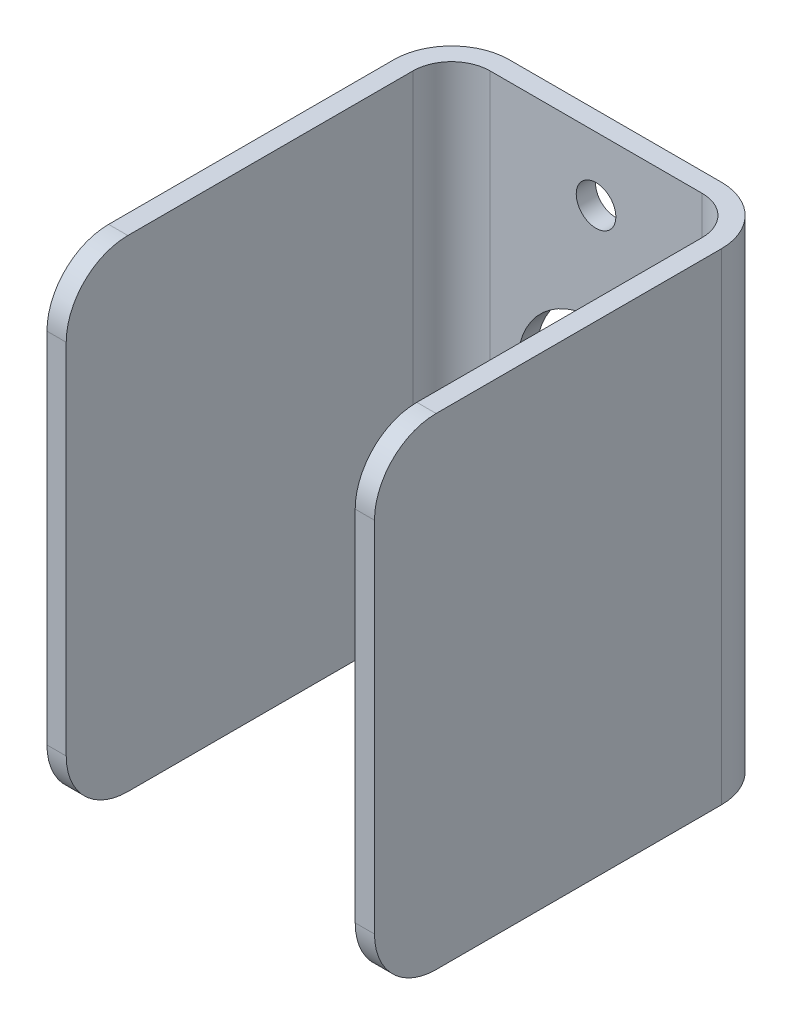
ISO-10303-21;
HEADER;
FILE_DESCRIPTION(('STEP AP214'),'2;1');
FILE_NAME('part.step','',(''),(''),'','','');
FILE_SCHEMA(('AUTOMOTIVE_DESIGN { 1 0 10303 214 1 1 1 1 }'));
ENDSEC;
DATA;
#1=APPLICATION_CONTEXT('core data for automotive mechanical design processes');
#2=APPLICATION_PROTOCOL_DEFINITION('international standard','automotive_design',2000,#1);
#3=PRODUCT_CONTEXT('',#1,'mechanical');
#4=PRODUCT('Part','Part','',(#3));
#5=PRODUCT_RELATED_PRODUCT_CATEGORY('part','',(#4));
#6=PRODUCT_DEFINITION_FORMATION('','',#4);
#7=PRODUCT_DEFINITION_CONTEXT('part definition',#1,'design');
#8=PRODUCT_DEFINITION('design','',#6,#7);
#9=PRODUCT_DEFINITION_SHAPE('','',#8);
#10=(LENGTH_UNIT() NAMED_UNIT(*) SI_UNIT(.MILLI.,.METRE.));
#11=(NAMED_UNIT(*) PLANE_ANGLE_UNIT() SI_UNIT($,.RADIAN.));
#12=(NAMED_UNIT(*) SI_UNIT($,.STERADIAN.) SOLID_ANGLE_UNIT());
#13=UNCERTAINTY_MEASURE_WITH_UNIT(LENGTH_MEASURE(1.E-05),#10,'distance_accuracy_value','');
#14=(GEOMETRIC_REPRESENTATION_CONTEXT(3) GLOBAL_UNCERTAINTY_ASSIGNED_CONTEXT((#13)) GLOBAL_UNIT_ASSIGNED_CONTEXT((#10,
#11,#12)) REPRESENTATION_CONTEXT('',''));
#15=CARTESIAN_POINT('',(0.,0.,0.));
#16=DIRECTION('',(0.,0.,1.));
#17=DIRECTION('',(1.,0.,0.));
#18=AXIS2_PLACEMENT_3D('',#15,#16,#17);
#19=CARTESIAN_POINT('',(19.84375,43.33875,35.7251));
#20=DIRECTION('',(-1.,0.,0.));
#21=DIRECTION('',(0.,0.,1.));
#22=AXIS2_PLACEMENT_3D('',#19,#20,#21);
#23=CYLINDRICAL_SURFACE('',#22,5.08);
#24=CARTESIAN_POINT('',(21.43125,43.33875,35.7251));
#25=DIRECTION('',(-1.,0.,0.));
#26=DIRECTION('',(0.,0.,1.));
#27=AXIS2_PLACEMENT_3D('',#24,#25,#26);
#28=CIRCLE('',#27,5.08);
#29=CARTESIAN_POINT('',(21.43125,43.33875,40.8051));
#30=VERTEX_POINT('',#29);
#31=CARTESIAN_POINT('',(21.43125,48.41875,35.7251));
#32=VERTEX_POINT('',#31);
#33=EDGE_CURVE('E212',#30,#32,#28,.T.);
#34=ORIENTED_EDGE('',*,*,#33,.T.);
#35=DIRECTION('',(-1.,0.,0.));
#36=VECTOR('',#35,1.);
#37=CARTESIAN_POINT('',(19.84375,48.41875,35.7251));
#38=LINE('',#37,#36);
#39=CARTESIAN_POINT('',(19.84375,48.41875,35.7251));
#40=VERTEX_POINT('',#39);
#41=EDGE_CURVE('E138',#32,#40,#38,.T.);
#42=ORIENTED_EDGE('',*,*,#41,.T.);
#43=CARTESIAN_POINT('',(19.84375,43.33875,35.7251));
#44=DIRECTION('',(-1.,0.,0.));
#45=DIRECTION('',(0.,0.,1.));
#46=AXIS2_PLACEMENT_3D('',#43,#44,#45);
#47=CIRCLE('',#46,5.08);
#48=CARTESIAN_POINT('',(19.84375,43.33875,40.8051));
#49=VERTEX_POINT('',#48);
#50=EDGE_CURVE('E254',#49,#40,#47,.T.);
#51=ORIENTED_EDGE('',*,*,#50,.F.);
#52=DIRECTION('',(-1.,0.,0.));
#53=VECTOR('',#52,1.);
#54=CARTESIAN_POINT('',(19.84375,43.33875,40.8051));
#55=LINE('',#54,#53);
#56=EDGE_CURVE('E220',#49,#30,#55,.F.);
#57=ORIENTED_EDGE('',*,*,#56,.T.);
#58=EDGE_LOOP('',(#34,#42,#51,#57));
#59=FACE_BOUND('',#58,.T.);
#60=ADVANCED_FACE('F16',(#59),#23,.T.);
#61=CARTESIAN_POINT('',(19.84375,13.81125,35.7251));
#62=DIRECTION('',(-1.,0.,0.));
#63=DIRECTION('',(0.,0.,1.));
#64=AXIS2_PLACEMENT_3D('',#61,#62,#63);
#65=CYLINDRICAL_SURFACE('',#64,5.08);
#66=CARTESIAN_POINT('',(21.43125,13.81125,35.7251));
#67=DIRECTION('',(-1.,0.,0.));
#68=DIRECTION('',(0.,0.,1.));
#69=AXIS2_PLACEMENT_3D('',#66,#67,#68);
#70=CIRCLE('',#69,5.08);
#71=CARTESIAN_POINT('',(21.43125,8.73125,35.7251));
#72=VERTEX_POINT('',#71);
#73=CARTESIAN_POINT('',(21.43125,13.81125,40.8051));
#74=VERTEX_POINT('',#73);
#75=EDGE_CURVE('E129',#72,#74,#70,.T.);
#76=ORIENTED_EDGE('',*,*,#75,.T.);
#77=DIRECTION('',(-1.,0.,0.));
#78=VECTOR('',#77,1.);
#79=CARTESIAN_POINT('',(19.84375,13.81125,40.8051));
#80=LINE('',#79,#78);
#81=CARTESIAN_POINT('',(19.84375,13.81125,40.8051));
#82=VERTEX_POINT('',#81);
#83=EDGE_CURVE('E137',#74,#82,#80,.T.);
#84=ORIENTED_EDGE('',*,*,#83,.T.);
#85=CARTESIAN_POINT('',(19.84375,13.81125,35.7251));
#86=DIRECTION('',(-1.,0.,0.));
#87=DIRECTION('',(0.,0.,1.));
#88=AXIS2_PLACEMENT_3D('',#85,#86,#87);
#89=CIRCLE('',#88,5.08);
#90=CARTESIAN_POINT('',(19.84375,8.73125,35.7251));
#91=VERTEX_POINT('',#90);
#92=EDGE_CURVE('E132',#91,#82,#89,.T.);
#93=ORIENTED_EDGE('',*,*,#92,.F.);
#94=DIRECTION('',(-1.,0.,0.));
#95=VECTOR('',#94,1.);
#96=CARTESIAN_POINT('',(19.84375,8.73125,35.7251));
#97=LINE('',#96,#95);
#98=EDGE_CURVE('E126',#91,#72,#97,.F.);
#99=ORIENTED_EDGE('',*,*,#98,.T.);
#100=EDGE_LOOP('',(#76,#84,#93,#99));
#101=FACE_BOUND('',#100,.T.);
#102=ADVANCED_FACE('F128',(#101),#65,.T.);
#103=CARTESIAN_POINT('',(19.84375,28.575,40.8051));
#104=DIRECTION('',(0.,0.,-1.));
#105=DIRECTION('',(-1.,0.,0.));
#106=AXIS2_PLACEMENT_3D('',#103,#104,#105);
#107=PLANE('',#106);
#108=DIRECTION('',(0.,1.,0.));
#109=VECTOR('',#108,1.);
#110=CARTESIAN_POINT('',(19.84375,28.575,40.8051));
#111=LINE('',#110,#109);
#112=EDGE_CURVE('E208',#82,#49,#111,.T.);
#113=ORIENTED_EDGE('',*,*,#112,.F.);
#114=ORIENTED_EDGE('',*,*,#83,.F.);
#115=DIRECTION('',(0.,1.,0.));
#116=VECTOR('',#115,1.);
#117=CARTESIAN_POINT('',(21.43125,28.575,40.8051));
#118=LINE('',#117,#116);
#119=EDGE_CURVE('E148',#74,#30,#118,.T.);
#120=ORIENTED_EDGE('',*,*,#119,.T.);
#121=ORIENTED_EDGE('',*,*,#56,.F.);
#122=EDGE_LOOP('',(#113,#114,#120,#121));
#123=FACE_BOUND('',#122,.T.);
#124=ADVANCED_FACE('F273',(#123),#107,.F.);
#125=CARTESIAN_POINT('',(33.3375,43.18,9.0551));
#126=DIRECTION('',(0.,0.,-1.));
#127=DIRECTION('',(-1.,0.,0.));
#128=AXIS2_PLACEMENT_3D('',#125,#126,#127);
#129=CYLINDRICAL_SURFACE('',#128,1.63195);
#130=CARTESIAN_POINT('',(33.3375,43.18,7.4676));
#131=DIRECTION('',(0.,0.,-1.));
#132=DIRECTION('',(-1.,0.,0.));
#133=AXIS2_PLACEMENT_3D('',#130,#131,#132);
#134=CIRCLE('',#133,1.63195);
#135=CARTESIAN_POINT('',(31.70555,43.18,7.4676));
#136=VERTEX_POINT('',#135);
#137=EDGE_CURVE('E205',#136,#136,#134,.T.);
#138=ORIENTED_EDGE('',*,*,#137,.T.);
#139=EDGE_LOOP('',(#138));
#140=FACE_BOUND('',#139,.T.);
#141=CARTESIAN_POINT('',(33.3375,43.18,9.0551));
#142=DIRECTION('',(0.,0.,-1.));
#143=DIRECTION('',(-1.,0.,0.));
#144=AXIS2_PLACEMENT_3D('',#141,#142,#143);
#145=CIRCLE('',#144,1.63195);
#146=CARTESIAN_POINT('',(31.70555,43.18,9.0551));
#147=VERTEX_POINT('',#146);
#148=EDGE_CURVE('E19',#147,#147,#145,.T.);
#149=ORIENTED_EDGE('',*,*,#148,.F.);
#150=EDGE_LOOP('',(#149));
#151=FACE_BOUND('',#150,.T.);
#152=ADVANCED_FACE('F270',(#140,#151),#129,.F.);
#153=CARTESIAN_POINT('',(33.3375,13.97,9.0551));
#154=DIRECTION('',(0.,0.,-1.));
#155=DIRECTION('',(-1.,0.,0.));
#156=AXIS2_PLACEMENT_3D('',#153,#154,#155);
#157=CYLINDRICAL_SURFACE('',#156,1.63195);
#158=CARTESIAN_POINT('',(33.3375,13.97,7.4676));
#159=DIRECTION('',(0.,0.,-1.));
#160=DIRECTION('',(-1.,0.,0.));
#161=AXIS2_PLACEMENT_3D('',#158,#159,#160);
#162=CIRCLE('',#161,1.63195);
#163=CARTESIAN_POINT('',(31.70555,13.97,7.4676));
#164=VERTEX_POINT('',#163);
#165=EDGE_CURVE('E248',#164,#164,#162,.T.);
#166=ORIENTED_EDGE('',*,*,#165,.T.);
#167=EDGE_LOOP('',(#166));
#168=FACE_BOUND('',#167,.T.);
#169=CARTESIAN_POINT('',(33.3375,13.97,9.0551));
#170=DIRECTION('',(0.,0.,-1.));
#171=DIRECTION('',(-1.,0.,0.));
#172=AXIS2_PLACEMENT_3D('',#169,#170,#171);
#173=CIRCLE('',#172,1.63195);
#174=CARTESIAN_POINT('',(31.70555,13.97,9.0551));
#175=VERTEX_POINT('',#174);
#176=EDGE_CURVE('E260',#175,#175,#173,.T.);
#177=ORIENTED_EDGE('',*,*,#176,.F.);
#178=EDGE_LOOP('',(#177));
#179=FACE_BOUND('',#178,.T.);
#180=ADVANCED_FACE('F272',(#168,#179),#157,.F.);
#181=CARTESIAN_POINT('',(33.3375,28.575,9.0551));
#182=DIRECTION('',(0.,0.,-1.));
#183=DIRECTION('',(-1.,0.,0.));
#184=AXIS2_PLACEMENT_3D('',#181,#182,#183);
#185=CYLINDRICAL_SURFACE('',#184,6.477);
#186=CARTESIAN_POINT('',(33.3375,28.575,7.4676));
#187=DIRECTION('',(0.,0.,-1.));
#188=DIRECTION('',(-1.,0.,0.));
#189=AXIS2_PLACEMENT_3D('',#186,#187,#188);
#190=CIRCLE('',#189,6.477);
#191=CARTESIAN_POINT('',(26.8605,28.575,7.4676));
#192=VERTEX_POINT('',#191);
#193=EDGE_CURVE('E202',#192,#192,#190,.T.);
#194=ORIENTED_EDGE('',*,*,#193,.T.);
#195=EDGE_LOOP('',(#194));
#196=FACE_BOUND('',#195,.T.);
#197=CARTESIAN_POINT('',(33.3375,28.575,9.0551));
#198=DIRECTION('',(0.,0.,-1.));
#199=DIRECTION('',(-1.,0.,0.));
#200=AXIS2_PLACEMENT_3D('',#197,#198,#199);
#201=CIRCLE('',#200,6.477);
#202=CARTESIAN_POINT('',(26.8605,28.575,9.0551));
#203=VERTEX_POINT('',#202);
#204=EDGE_CURVE('E216',#203,#203,#201,.T.);
#205=ORIENTED_EDGE('',*,*,#204,.F.);
#206=EDGE_LOOP('',(#205));
#207=FACE_BOUND('',#206,.T.);
#208=ADVANCED_FACE('F281',(#196,#207),#185,.F.);
#209=CARTESIAN_POINT('',(46.83125,28.575,9.0551));
#210=DIRECTION('',(0.,0.,1.));
#211=DIRECTION('',(1.,0.,0.));
#212=AXIS2_PLACEMENT_3D('',#209,#210,#211);
#213=PLANE('',#212);
#214=ORIENTED_EDGE('',*,*,#204,.T.);
#215=EDGE_LOOP('',(#214));
#216=FACE_BOUND('',#215,.T.);
#217=ORIENTED_EDGE('',*,*,#176,.T.);
#218=EDGE_LOOP('',(#217));
#219=FACE_BOUND('',#218,.T.);
#220=ORIENTED_EDGE('',*,*,#148,.T.);
#221=EDGE_LOOP('',(#220));
#222=FACE_BOUND('',#221,.T.);
#223=DIRECTION('',(0.,1.,0.));
#224=VECTOR('',#223,1.);
#225=CARTESIAN_POINT('',(24.60625,28.575,9.0551));
#226=LINE('',#225,#224);
#227=CARTESIAN_POINT('',(24.60625,48.41875,9.0551));
#228=VERTEX_POINT('',#227);
#229=CARTESIAN_POINT('',(24.60625,8.73125,9.0551));
#230=VERTEX_POINT('',#229);
#231=EDGE_CURVE('E214',#228,#230,#226,.F.);
#232=ORIENTED_EDGE('',*,*,#231,.T.);
#233=DIRECTION('',(1.,0.,0.));
#234=VECTOR('',#233,1.);
#235=CARTESIAN_POINT('',(46.83125,8.73125,9.0551));
#236=LINE('',#235,#234);
#237=CARTESIAN_POINT('',(42.06875,8.73125,9.0551));
#238=VERTEX_POINT('',#237);
#239=EDGE_CURVE('E160',#238,#230,#236,.F.);
#240=ORIENTED_EDGE('',*,*,#239,.F.);
#241=DIRECTION('',(0.,-1.,0.));
#242=VECTOR('',#241,1.);
#243=CARTESIAN_POINT('',(42.06875,28.575,9.0551));
#244=LINE('',#243,#242);
#245=CARTESIAN_POINT('',(42.06875,48.41875,9.0551));
#246=VERTEX_POINT('',#245);
#247=EDGE_CURVE('E174',#238,#246,#244,.F.);
#248=ORIENTED_EDGE('',*,*,#247,.T.);
#249=DIRECTION('',(1.,0.,0.));
#250=VECTOR('',#249,1.);
#251=CARTESIAN_POINT('',(46.83125,48.41875,9.0551));
#252=LINE('',#251,#250);
#253=EDGE_CURVE('E171',#228,#246,#252,.T.);
#254=ORIENTED_EDGE('',*,*,#253,.F.);
#255=EDGE_LOOP('',(#232,#240,#248,#254));
#256=FACE_BOUND('',#255,.T.);
#257=ADVANCED_FACE('F267',(#216,#219,#222,#256),#213,.T.);
#258=CARTESIAN_POINT('',(24.60625,28.575,12.2301));
#259=DIRECTION('',(0.,1.,0.));
#260=DIRECTION('',(0.,0.,1.));
#261=AXIS2_PLACEMENT_3D('',#258,#259,#260);
#262=CYLINDRICAL_SURFACE('',#261,3.175);
#263=DIRECTION('',(0.,1.,0.));
#264=VECTOR('',#263,1.);
#265=CARTESIAN_POINT('',(21.43125,28.575,12.2301));
#266=LINE('',#265,#264);
#267=CARTESIAN_POINT('',(21.43125,48.41875,12.2301));
#268=VERTEX_POINT('',#267);
#269=CARTESIAN_POINT('',(21.43125,8.73125,12.2301));
#270=VERTEX_POINT('',#269);
#271=EDGE_CURVE('E149',#268,#270,#266,.F.);
#272=ORIENTED_EDGE('',*,*,#271,.T.);
#273=CARTESIAN_POINT('',(24.60625,8.73125,12.2301));
#274=DIRECTION('',(0.,1.,0.));
#275=DIRECTION('',(0.,0.,1.));
#276=AXIS2_PLACEMENT_3D('',#273,#274,#275);
#277=CIRCLE('',#276,3.175);
#278=EDGE_CURVE('E155',#230,#270,#277,.T.);
#279=ORIENTED_EDGE('',*,*,#278,.F.);
#280=ORIENTED_EDGE('',*,*,#231,.F.);
#281=CARTESIAN_POINT('',(24.60625,48.41875,12.2301));
#282=DIRECTION('',(0.,1.,0.));
#283=DIRECTION('',(0.,0.,1.));
#284=AXIS2_PLACEMENT_3D('',#281,#282,#283);
#285=CIRCLE('',#284,3.175);
#286=EDGE_CURVE('E175',#268,#228,#285,.F.);
#287=ORIENTED_EDGE('',*,*,#286,.F.);
#288=EDGE_LOOP('',(#272,#279,#280,#287));
#289=FACE_BOUND('',#288,.T.);
#290=ADVANCED_FACE('F336',(#289),#262,.F.);
#291=CARTESIAN_POINT('',(21.43125,28.575,40.8051));
#292=DIRECTION('',(-1.,0.,0.));
#293=DIRECTION('',(0.,0.,1.));
#294=AXIS2_PLACEMENT_3D('',#291,#292,#293);
#295=PLANE('',#294);
#296=ORIENTED_EDGE('',*,*,#119,.F.);
#297=ORIENTED_EDGE('',*,*,#75,.F.);
#298=DIRECTION('',(0.,0.,-1.));
#299=VECTOR('',#298,1.);
#300=CARTESIAN_POINT('',(21.43125,8.73125,26.5176));
#301=LINE('',#300,#299);
#302=EDGE_CURVE('E144',#270,#72,#301,.F.);
#303=ORIENTED_EDGE('',*,*,#302,.F.);
#304=ORIENTED_EDGE('',*,*,#271,.F.);
#305=DIRECTION('',(0.,0.,1.));
#306=VECTOR('',#305,1.);
#307=CARTESIAN_POINT('',(21.43125,48.41875,26.5176));
#308=LINE('',#307,#306);
#309=EDGE_CURVE('E176',#32,#268,#308,.F.);
#310=ORIENTED_EDGE('',*,*,#309,.F.);
#311=ORIENTED_EDGE('',*,*,#33,.F.);
#312=EDGE_LOOP('',(#296,#297,#303,#304,#310,#311));
#313=FACE_BOUND('',#312,.T.);
#314=ADVANCED_FACE('F143',(#313),#295,.F.);
#315=CARTESIAN_POINT('',(19.84375,28.575,40.8051));
#316=DIRECTION('',(-1.,0.,0.));
#317=DIRECTION('',(0.,0.,1.));
#318=AXIS2_PLACEMENT_3D('',#315,#316,#317);
#319=PLANE('',#318);
#320=ORIENTED_EDGE('',*,*,#92,.T.);
#321=ORIENTED_EDGE('',*,*,#112,.T.);
#322=ORIENTED_EDGE('',*,*,#50,.T.);
#323=DIRECTION('',(0.,0.,1.));
#324=VECTOR('',#323,1.);
#325=CARTESIAN_POINT('',(19.84375,48.41875,26.5176));
#326=LINE('',#325,#324);
#327=CARTESIAN_POINT('',(19.84375,48.41875,12.2301));
#328=VERTEX_POINT('',#327);
#329=EDGE_CURVE('E179',#328,#40,#326,.T.);
#330=ORIENTED_EDGE('',*,*,#329,.F.);
#331=DIRECTION('',(0.,1.,0.));
#332=VECTOR('',#331,1.);
#333=CARTESIAN_POINT('',(19.84375,28.575,12.2301));
#334=LINE('',#333,#332);
#335=CARTESIAN_POINT('',(19.84375,8.73125,12.2301));
#336=VERTEX_POINT('',#335);
#337=EDGE_CURVE('E206',#336,#328,#334,.T.);
#338=ORIENTED_EDGE('',*,*,#337,.F.);
#339=DIRECTION('',(0.,0.,-1.));
#340=VECTOR('',#339,1.);
#341=CARTESIAN_POINT('',(19.84375,8.73125,26.5176));
#342=LINE('',#341,#340);
#343=EDGE_CURVE('E156',#91,#336,#342,.T.);
#344=ORIENTED_EDGE('',*,*,#343,.F.);
#345=EDGE_LOOP('',(#320,#321,#322,#330,#338,#344));
#346=FACE_BOUND('',#345,.T.);
#347=ADVANCED_FACE('F329',(#346),#319,.T.);
#348=CARTESIAN_POINT('',(24.60625,28.575,12.2301));
#349=DIRECTION('',(0.,1.,0.));
#350=DIRECTION('',(0.,0.,1.));
#351=AXIS2_PLACEMENT_3D('',#348,#349,#350);
#352=CYLINDRICAL_SURFACE('',#351,4.7625);
#353=CARTESIAN_POINT('',(24.60625,8.73125,12.2301));
#354=DIRECTION('',(0.,1.,0.));
#355=DIRECTION('',(0.,0.,1.));
#356=AXIS2_PLACEMENT_3D('',#353,#354,#355);
#357=CIRCLE('',#356,4.7625);
#358=CARTESIAN_POINT('',(24.60625,8.73125,7.4676));
#359=VERTEX_POINT('',#358);
#360=EDGE_CURVE('E158',#336,#359,#357,.F.);
#361=ORIENTED_EDGE('',*,*,#360,.F.);
#362=ORIENTED_EDGE('',*,*,#337,.T.);
#363=CARTESIAN_POINT('',(24.60625,48.41875,12.2301));
#364=DIRECTION('',(0.,1.,0.));
#365=DIRECTION('',(0.,0.,1.));
#366=AXIS2_PLACEMENT_3D('',#363,#364,#365);
#367=CIRCLE('',#366,4.7625);
#368=CARTESIAN_POINT('',(24.60625,48.41875,7.4676));
#369=VERTEX_POINT('',#368);
#370=EDGE_CURVE('E182',#369,#328,#367,.T.);
#371=ORIENTED_EDGE('',*,*,#370,.F.);
#372=DIRECTION('',(0.,1.,0.));
#373=VECTOR('',#372,1.);
#374=CARTESIAN_POINT('',(24.60625,28.575,7.4676));
#375=LINE('',#374,#373);
#376=EDGE_CURVE('E203',#369,#359,#375,.F.);
#377=ORIENTED_EDGE('',*,*,#376,.T.);
#378=EDGE_LOOP('',(#361,#362,#371,#377));
#379=FACE_BOUND('',#378,.T.);
#380=ADVANCED_FACE('F325',(#379),#352,.T.);
#381=CARTESIAN_POINT('',(46.83125,28.575,7.4676));
#382=DIRECTION('',(0.,0.,1.));
#383=DIRECTION('',(1.,0.,0.));
#384=AXIS2_PLACEMENT_3D('',#381,#382,#383);
#385=PLANE('',#384);
#386=ORIENTED_EDGE('',*,*,#193,.F.);
#387=EDGE_LOOP('',(#386));
#388=FACE_BOUND('',#387,.T.);
#389=ORIENTED_EDGE('',*,*,#165,.F.);
#390=EDGE_LOOP('',(#389));
#391=FACE_BOUND('',#390,.T.);
#392=ORIENTED_EDGE('',*,*,#137,.F.);
#393=EDGE_LOOP('',(#392));
#394=FACE_BOUND('',#393,.T.);
#395=DIRECTION('',(1.,0.,0.));
#396=VECTOR('',#395,1.);
#397=CARTESIAN_POINT('',(46.83125,8.73125,7.4676));
#398=LINE('',#397,#396);
#399=CARTESIAN_POINT('',(42.06875,8.73125,7.4676));
#400=VERTEX_POINT('',#399);
#401=EDGE_CURVE('E233',#359,#400,#398,.T.);
#402=ORIENTED_EDGE('',*,*,#401,.F.);
#403=ORIENTED_EDGE('',*,*,#376,.F.);
#404=DIRECTION('',(1.,0.,0.));
#405=VECTOR('',#404,1.);
#406=CARTESIAN_POINT('',(46.83125,48.41875,7.4676));
#407=LINE('',#406,#405);
#408=CARTESIAN_POINT('',(42.06875,48.41875,7.4676));
#409=VERTEX_POINT('',#408);
#410=EDGE_CURVE('E183',#409,#369,#407,.F.);
#411=ORIENTED_EDGE('',*,*,#410,.F.);
#412=DIRECTION('',(0.,-1.,0.));
#413=VECTOR('',#412,1.);
#414=CARTESIAN_POINT('',(42.06875,28.575,7.4676));
#415=LINE('',#414,#413);
#416=EDGE_CURVE('E200',#400,#409,#415,.F.);
#417=ORIENTED_EDGE('',*,*,#416,.F.);
#418=EDGE_LOOP('',(#402,#403,#411,#417));
#419=FACE_BOUND('',#418,.T.);
#420=ADVANCED_FACE('F321',(#388,#391,#394,#419),#385,.F.);
#421=CARTESIAN_POINT('',(42.06875,28.575,12.2301));
#422=DIRECTION('',(0.,-1.,0.));
#423=DIRECTION('',(0.,0.,-1.));
#424=AXIS2_PLACEMENT_3D('',#421,#422,#423);
#425=CYLINDRICAL_SURFACE('',#424,4.7625);
#426=CARTESIAN_POINT('',(42.06875,8.73125,12.2301));
#427=DIRECTION('',(0.,-1.,0.));
#428=DIRECTION('',(0.,0.,-1.));
#429=AXIS2_PLACEMENT_3D('',#426,#427,#428);
#430=CIRCLE('',#429,4.7625);
#431=CARTESIAN_POINT('',(46.83125,8.73125,12.2301));
#432=VERTEX_POINT('',#431);
#433=EDGE_CURVE('E231',#400,#432,#430,.T.);
#434=ORIENTED_EDGE('',*,*,#433,.F.);
#435=ORIENTED_EDGE('',*,*,#416,.T.);
#436=CARTESIAN_POINT('',(42.06875,48.41875,12.2301));
#437=DIRECTION('',(0.,-1.,0.));
#438=DIRECTION('',(0.,0.,-1.));
#439=AXIS2_PLACEMENT_3D('',#436,#437,#438);
#440=CIRCLE('',#439,4.7625);
#441=CARTESIAN_POINT('',(46.83125,48.41875,12.2301));
#442=VERTEX_POINT('',#441);
#443=EDGE_CURVE('E186',#442,#409,#440,.F.);
#444=ORIENTED_EDGE('',*,*,#443,.F.);
#445=DIRECTION('',(0.,1.,0.));
#446=VECTOR('',#445,1.);
#447=CARTESIAN_POINT('',(46.83125,28.575,12.2301));
#448=LINE('',#447,#446);
#449=EDGE_CURVE('E198',#442,#432,#448,.F.);
#450=ORIENTED_EDGE('',*,*,#449,.T.);
#451=EDGE_LOOP('',(#434,#435,#444,#450));
#452=FACE_BOUND('',#451,.T.);
#453=ADVANCED_FACE('F317',(#452),#425,.T.);
#454=CARTESIAN_POINT('',(46.83125,28.575,40.8051));
#455=DIRECTION('',(-1.,0.,0.));
#456=DIRECTION('',(0.,0.,1.));
#457=AXIS2_PLACEMENT_3D('',#454,#455,#456);
#458=PLANE('',#457);
#459=DIRECTION('',(0.,1.,0.));
#460=VECTOR('',#459,1.);
#461=CARTESIAN_POINT('',(46.83125,28.575,40.8051));
#462=LINE('',#461,#460);
#463=CARTESIAN_POINT('',(46.83125,13.81125,40.8051));
#464=VERTEX_POINT('',#463);
#465=CARTESIAN_POINT('',(46.83125,43.33875,40.8051));
#466=VERTEX_POINT('',#465);
#467=EDGE_CURVE('E194',#464,#466,#462,.T.);
#468=ORIENTED_EDGE('',*,*,#467,.F.);
#469=CARTESIAN_POINT('',(46.83125,13.81125,35.7251));
#470=DIRECTION('',(-1.,0.,0.));
#471=DIRECTION('',(0.,0.,1.));
#472=AXIS2_PLACEMENT_3D('',#469,#470,#471);
#473=CIRCLE('',#472,5.08);
#474=CARTESIAN_POINT('',(46.83125,8.73125,35.7251));
#475=VERTEX_POINT('',#474);
#476=EDGE_CURVE('E227',#475,#464,#473,.T.);
#477=ORIENTED_EDGE('',*,*,#476,.F.);
#478=DIRECTION('',(0.,0.,-1.));
#479=VECTOR('',#478,1.);
#480=CARTESIAN_POINT('',(46.83125,8.73125,26.5176));
#481=LINE('',#480,#479);
#482=EDGE_CURVE('E230',#432,#475,#481,.F.);
#483=ORIENTED_EDGE('',*,*,#482,.F.);
#484=ORIENTED_EDGE('',*,*,#449,.F.);
#485=DIRECTION('',(0.,0.,1.));
#486=VECTOR('',#485,1.);
#487=CARTESIAN_POINT('',(46.83125,48.41875,26.5176));
#488=LINE('',#487,#486);
#489=CARTESIAN_POINT('',(46.83125,48.41875,35.7251));
#490=VERTEX_POINT('',#489);
#491=EDGE_CURVE('E187',#490,#442,#488,.F.);
#492=ORIENTED_EDGE('',*,*,#491,.F.);
#493=CARTESIAN_POINT('',(46.83125,43.33875,35.7251));
#494=DIRECTION('',(-1.,0.,0.));
#495=DIRECTION('',(0.,0.,1.));
#496=AXIS2_PLACEMENT_3D('',#493,#494,#495);
#497=CIRCLE('',#496,5.08);
#498=EDGE_CURVE('E193',#466,#490,#497,.T.);
#499=ORIENTED_EDGE('',*,*,#498,.F.);
#500=EDGE_LOOP('',(#468,#477,#483,#484,#492,#499));
#501=FACE_BOUND('',#500,.T.);
#502=ADVANCED_FACE('F313',(#501),#458,.F.);
#503=CARTESIAN_POINT('',(46.83125,43.33875,35.7251));
#504=DIRECTION('',(-1.,0.,0.));
#505=DIRECTION('',(0.,0.,1.));
#506=AXIS2_PLACEMENT_3D('',#503,#504,#505);
#507=CYLINDRICAL_SURFACE('',#506,5.08);
#508=CARTESIAN_POINT('',(45.24375,43.33875,35.7251));
#509=DIRECTION('',(-1.,0.,0.));
#510=DIRECTION('',(0.,0.,1.));
#511=AXIS2_PLACEMENT_3D('',#508,#509,#510);
#512=CIRCLE('',#511,5.08);
#513=CARTESIAN_POINT('',(45.24375,43.33875,40.8051));
#514=VERTEX_POINT('',#513);
#515=CARTESIAN_POINT('',(45.24375,48.41875,35.7251));
#516=VERTEX_POINT('',#515);
#517=EDGE_CURVE('E197',#514,#516,#512,.T.);
#518=ORIENTED_EDGE('',*,*,#517,.F.);
#519=DIRECTION('',(1.,0.,0.));
#520=VECTOR('',#519,1.);
#521=CARTESIAN_POINT('',(46.83125,43.33875,40.8051));
#522=LINE('',#521,#520);
#523=EDGE_CURVE('E371',#466,#514,#522,.F.);
#524=ORIENTED_EDGE('',*,*,#523,.F.);
#525=ORIENTED_EDGE('',*,*,#498,.T.);
#526=DIRECTION('',(1.,0.,0.));
#527=VECTOR('',#526,1.);
#528=CARTESIAN_POINT('',(46.83125,48.41875,35.7251));
#529=LINE('',#528,#527);
#530=EDGE_CURVE('E190',#516,#490,#529,.T.);
#531=ORIENTED_EDGE('',*,*,#530,.F.);
#532=EDGE_LOOP('',(#518,#524,#525,#531));
#533=FACE_BOUND('',#532,.T.);
#534=ADVANCED_FACE('F309',(#533),#507,.T.);
#535=CARTESIAN_POINT('',(46.83125,48.41875,26.5176));
#536=DIRECTION('',(0.,1.,0.));
#537=DIRECTION('',(0.,0.,1.));
#538=AXIS2_PLACEMENT_3D('',#535,#536,#537);
#539=PLANE('',#538);
#540=CARTESIAN_POINT('',(42.06875,48.41875,12.2301));
#541=DIRECTION('',(0.,-1.,0.));
#542=DIRECTION('',(0.,0.,-1.));
#543=AXIS2_PLACEMENT_3D('',#540,#541,#542);
#544=CIRCLE('',#543,3.175);
#545=CARTESIAN_POINT('',(45.24375,48.41875,12.2301));
#546=VERTEX_POINT('',#545);
#547=EDGE_CURVE('E218',#246,#546,#544,.T.);
#548=ORIENTED_EDGE('',*,*,#547,.T.);
#549=DIRECTION('',(0.,0.,1.));
#550=VECTOR('',#549,1.);
#551=CARTESIAN_POINT('',(45.24375,48.41875,40.8051));
#552=LINE('',#551,#550);
#553=EDGE_CURVE('E170',#516,#546,#552,.F.);
#554=ORIENTED_EDGE('',*,*,#553,.F.);
#555=ORIENTED_EDGE('',*,*,#530,.T.);
#556=ORIENTED_EDGE('',*,*,#491,.T.);
#557=ORIENTED_EDGE('',*,*,#443,.T.);
#558=ORIENTED_EDGE('',*,*,#410,.T.);
#559=ORIENTED_EDGE('',*,*,#370,.T.);
#560=ORIENTED_EDGE('',*,*,#329,.T.);
#561=ORIENTED_EDGE('',*,*,#41,.F.);
#562=ORIENTED_EDGE('',*,*,#309,.T.);
#563=ORIENTED_EDGE('',*,*,#286,.T.);
#564=ORIENTED_EDGE('',*,*,#253,.T.);
#565=EDGE_LOOP('',(#548,#554,#555,#556,#557,#558,#559,#560,#561,#562,#563,#564));
#566=FACE_BOUND('',#565,.T.);
#567=ADVANCED_FACE('F305',(#566),#539,.T.);
#568=CARTESIAN_POINT('',(42.06875,28.575,12.2301));
#569=DIRECTION('',(0.,-1.,0.));
#570=DIRECTION('',(0.,0.,-1.));
#571=AXIS2_PLACEMENT_3D('',#568,#569,#570);
#572=CYLINDRICAL_SURFACE('',#571,3.175);
#573=ORIENTED_EDGE('',*,*,#247,.F.);
#574=CARTESIAN_POINT('',(42.06875,8.73125,12.2301));
#575=DIRECTION('',(0.,-1.,0.));
#576=DIRECTION('',(0.,0.,-1.));
#577=AXIS2_PLACEMENT_3D('',#574,#575,#576);
#578=CIRCLE('',#577,3.175);
#579=CARTESIAN_POINT('',(45.24375,8.73125,12.2301));
#580=VERTEX_POINT('',#579);
#581=EDGE_CURVE('E165',#580,#238,#578,.F.);
#582=ORIENTED_EDGE('',*,*,#581,.F.);
#583=DIRECTION('',(0.,1.,0.));
#584=VECTOR('',#583,1.);
#585=CARTESIAN_POINT('',(45.24375,28.575,12.2301));
#586=LINE('',#585,#584);
#587=EDGE_CURVE('E166',#546,#580,#586,.F.);
#588=ORIENTED_EDGE('',*,*,#587,.F.);
#589=ORIENTED_EDGE('',*,*,#547,.F.);
#590=EDGE_LOOP('',(#573,#582,#588,#589));
#591=FACE_BOUND('',#590,.T.);
#592=ADVANCED_FACE('F302',(#591),#572,.F.);
#593=CARTESIAN_POINT('',(46.83125,8.73125,26.5176));
#594=DIRECTION('',(0.,-1.,0.));
#595=DIRECTION('',(0.,0.,-1.));
#596=AXIS2_PLACEMENT_3D('',#593,#594,#595);
#597=PLANE('',#596);
#598=ORIENTED_EDGE('',*,*,#433,.T.);
#599=ORIENTED_EDGE('',*,*,#482,.T.);
#600=DIRECTION('',(-1.,0.,0.));
#601=VECTOR('',#600,1.);
#602=CARTESIAN_POINT('',(46.83125,8.73125,35.7251));
#603=LINE('',#602,#601);
#604=CARTESIAN_POINT('',(45.24375,8.73125,35.7251));
#605=VERTEX_POINT('',#604);
#606=EDGE_CURVE('E229',#605,#475,#603,.F.);
#607=ORIENTED_EDGE('',*,*,#606,.F.);
#608=DIRECTION('',(0.,0.,1.));
#609=VECTOR('',#608,1.);
#610=CARTESIAN_POINT('',(45.24375,8.73125,40.8051));
#611=LINE('',#610,#609);
#612=EDGE_CURVE('E169',#580,#605,#611,.T.);
#613=ORIENTED_EDGE('',*,*,#612,.F.);
#614=ORIENTED_EDGE('',*,*,#581,.T.);
#615=ORIENTED_EDGE('',*,*,#239,.T.);
#616=ORIENTED_EDGE('',*,*,#278,.T.);
#617=ORIENTED_EDGE('',*,*,#302,.T.);
#618=ORIENTED_EDGE('',*,*,#98,.F.);
#619=ORIENTED_EDGE('',*,*,#343,.T.);
#620=ORIENTED_EDGE('',*,*,#360,.T.);
#621=ORIENTED_EDGE('',*,*,#401,.T.);
#622=EDGE_LOOP('',(#598,#599,#607,#613,#614,#615,#616,#617,#618,#619,#620,#621));
#623=FACE_BOUND('',#622,.T.);
#624=ADVANCED_FACE('F152',(#623),#597,.T.);
#625=CARTESIAN_POINT('',(46.83125,13.81125,35.7251));
#626=DIRECTION('',(-1.,0.,0.));
#627=DIRECTION('',(0.,0.,1.));
#628=AXIS2_PLACEMENT_3D('',#625,#626,#627);
#629=CYLINDRICAL_SURFACE('',#628,5.08);
#630=CARTESIAN_POINT('',(45.24375,13.81125,35.7251));
#631=DIRECTION('',(-1.,0.,0.));
#632=DIRECTION('',(0.,0.,1.));
#633=AXIS2_PLACEMENT_3D('',#630,#631,#632);
#634=CIRCLE('',#633,5.08);
#635=CARTESIAN_POINT('',(45.24375,13.81125,40.8051));
#636=VERTEX_POINT('',#635);
#637=EDGE_CURVE('E25',#605,#636,#634,.T.);
#638=ORIENTED_EDGE('',*,*,#637,.F.);
#639=ORIENTED_EDGE('',*,*,#606,.T.);
#640=ORIENTED_EDGE('',*,*,#476,.T.);
#641=DIRECTION('',(1.,0.,0.));
#642=VECTOR('',#641,1.);
#643=CARTESIAN_POINT('',(46.83125,13.81125,40.8051));
#644=LINE('',#643,#642);
#645=EDGE_CURVE('E34',#636,#464,#644,.T.);
#646=ORIENTED_EDGE('',*,*,#645,.F.);
#647=EDGE_LOOP('',(#638,#639,#640,#646));
#648=FACE_BOUND('',#647,.T.);
#649=ADVANCED_FACE('F294',(#648),#629,.T.);
#650=CARTESIAN_POINT('',(46.83125,28.575,40.8051));
#651=DIRECTION('',(0.,0.,1.));
#652=DIRECTION('',(1.,0.,0.));
#653=AXIS2_PLACEMENT_3D('',#650,#651,#652);
#654=PLANE('',#653);
#655=ORIENTED_EDGE('',*,*,#645,.T.);
#656=ORIENTED_EDGE('',*,*,#467,.T.);
#657=ORIENTED_EDGE('',*,*,#523,.T.);
#658=DIRECTION('',(0.,1.,0.));
#659=VECTOR('',#658,1.);
#660=CARTESIAN_POINT('',(45.24375,28.575,40.8051));
#661=LINE('',#660,#659);
#662=EDGE_CURVE('E11',#636,#514,#661,.T.);
#663=ORIENTED_EDGE('',*,*,#662,.F.);
#664=EDGE_LOOP('',(#655,#656,#657,#663));
#665=FACE_BOUND('',#664,.T.);
#666=ADVANCED_FACE('F288',(#665),#654,.T.);
#667=CARTESIAN_POINT('',(45.24375,28.575,40.8051));
#668=DIRECTION('',(-1.,0.,0.));
#669=DIRECTION('',(0.,0.,1.));
#670=AXIS2_PLACEMENT_3D('',#667,#668,#669);
#671=PLANE('',#670);
#672=ORIENTED_EDGE('',*,*,#637,.T.);
#673=ORIENTED_EDGE('',*,*,#662,.T.);
#674=ORIENTED_EDGE('',*,*,#517,.T.);
#675=ORIENTED_EDGE('',*,*,#553,.T.);
#676=ORIENTED_EDGE('',*,*,#587,.T.);
#677=ORIENTED_EDGE('',*,*,#612,.T.);
#678=EDGE_LOOP('',(#672,#673,#674,#675,#676,#677));
#679=FACE_BOUND('',#678,.T.);
#680=ADVANCED_FACE('F286',(#679),#671,.T.);
#681=CLOSED_SHELL('',(#60,#102,#124,#152,#180,#208,#257,#290,#314,#347,#380,#420,#453,#502,#534,
#567,#592,#624,#649,#666,#680));
#682=MANIFOLD_SOLID_BREP('B1',#681);
#683=ADVANCED_BREP_SHAPE_REPRESENTATION('',(#18,#682),#14);
#684=SHAPE_DEFINITION_REPRESENTATION(#9,#683);
ENDSEC;
END-ISO-10303-21;
